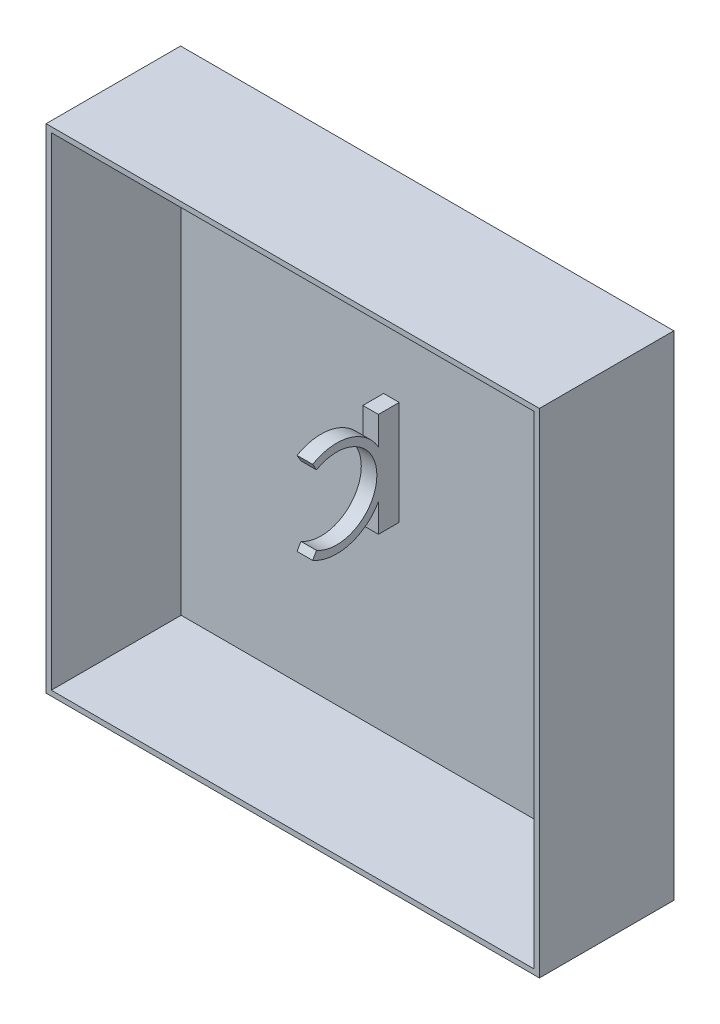
ISO-10303-21;
HEADER;
FILE_DESCRIPTION(('STEP AP214'),'2;1');
FILE_NAME('part.step','',(''),(''),'','','');
FILE_SCHEMA(('AUTOMOTIVE_DESIGN { 1 0 10303 214 1 1 1 1 }'));
ENDSEC;
DATA;
#1=APPLICATION_CONTEXT('core data for automotive mechanical design processes');
#2=APPLICATION_PROTOCOL_DEFINITION('international standard','automotive_design',2000,#1);
#3=PRODUCT_CONTEXT('',#1,'mechanical');
#4=PRODUCT('Part','Part','',(#3));
#5=PRODUCT_RELATED_PRODUCT_CATEGORY('part','',(#4));
#6=PRODUCT_DEFINITION_FORMATION('','',#4);
#7=PRODUCT_DEFINITION_CONTEXT('part definition',#1,'design');
#8=PRODUCT_DEFINITION('design','',#6,#7);
#9=PRODUCT_DEFINITION_SHAPE('','',#8);
#10=(LENGTH_UNIT() NAMED_UNIT(*) SI_UNIT(.MILLI.,.METRE.));
#11=(NAMED_UNIT(*) PLANE_ANGLE_UNIT() SI_UNIT($,.RADIAN.));
#12=(NAMED_UNIT(*) SI_UNIT($,.STERADIAN.) SOLID_ANGLE_UNIT());
#13=UNCERTAINTY_MEASURE_WITH_UNIT(LENGTH_MEASURE(1.E-05),#10,'distance_accuracy_value','');
#14=(GEOMETRIC_REPRESENTATION_CONTEXT(3) GLOBAL_UNCERTAINTY_ASSIGNED_CONTEXT((#13)) GLOBAL_UNIT_ASSIGNED_CONTEXT((#10,
#11,#12)) REPRESENTATION_CONTEXT('',''));
#15=CARTESIAN_POINT('',(0.,0.,0.));
#16=DIRECTION('',(0.,0.,1.));
#17=DIRECTION('',(1.,0.,0.));
#18=AXIS2_PLACEMENT_3D('',#15,#16,#17);
#19=CARTESIAN_POINT('',(0.,0.,4.9));
#20=DIRECTION('',(0.,0.,1.));
#21=DIRECTION('',(1.,0.,0.));
#22=AXIS2_PLACEMENT_3D('',#19,#20,#21);
#23=PLANE('',#22);
#24=DIRECTION('',(0.,1.,0.));
#25=VECTOR('',#24,1.);
#26=CARTESIAN_POINT('',(-4.5,10.,4.9));
#27=LINE('',#26,#25);
#28=CARTESIAN_POINT('',(-4.49999999999999,-10.,4.9));
#29=VERTEX_POINT('',#28);
#30=CARTESIAN_POINT('',(-4.49999999999999,-4.5563142999578,4.9));
#31=VERTEX_POINT('',#30);
#32=EDGE_CURVE('E264',#29,#31,#27,.T.);
#33=ORIENTED_EDGE('',*,*,#32,.T.);
#34=DIRECTION('',(-1.,0.,0.));
#35=VECTOR('',#34,1.);
#36=CARTESIAN_POINT('',(-4.49999999999999,-4.5563142999578,4.9));
#37=LINE('',#36,#35);
#38=CARTESIAN_POINT('',(-7.49999999999999,-4.5563142999578,4.9));
#39=VERTEX_POINT('',#38);
#40=EDGE_CURVE('E229',#31,#39,#37,.T.);
#41=ORIENTED_EDGE('',*,*,#40,.T.);
#42=DIRECTION('',(0.,-1.,0.));
#43=VECTOR('',#42,1.);
#44=CARTESIAN_POINT('',(-7.49999999999999,10.,4.9));
#45=LINE('',#44,#43);
#46=CARTESIAN_POINT('',(-7.49999999999999,-10.,4.9));
#47=VERTEX_POINT('',#46);
#48=EDGE_CURVE('E261',#39,#47,#45,.T.);
#49=ORIENTED_EDGE('',*,*,#48,.T.);
#50=DIRECTION('',(1.,0.,0.));
#51=VECTOR('',#50,1.);
#52=CARTESIAN_POINT('',(-7.49999999999999,-10.,4.9));
#53=LINE('',#52,#51);
#54=EDGE_CURVE('E260',#47,#29,#53,.T.);
#55=ORIENTED_EDGE('',*,*,#54,.T.);
#56=EDGE_LOOP('',(#33,#41,#49,#55));
#57=FACE_BOUND('',#56,.T.);
#58=ADVANCED_FACE('F33',(#57),#23,.T.);
#59=CARTESIAN_POINT('',(0.,0.,0.9));
#60=DIRECTION('',(0.,0.,1.));
#61=DIRECTION('',(1.,0.,0.));
#62=AXIS2_PLACEMENT_3D('',#59,#60,#61);
#63=PLANE('',#62);
#64=DIRECTION('',(-1.,0.,0.));
#65=VECTOR('',#64,1.);
#66=CARTESIAN_POINT('',(46.5,46.5,0.9));
#67=LINE('',#66,#65);
#68=CARTESIAN_POINT('',(46.5,46.5,0.9));
#69=VERTEX_POINT('',#68);
#70=CARTESIAN_POINT('',(-46.5,46.5,0.9));
#71=VERTEX_POINT('',#70);
#72=EDGE_CURVE('E285',#69,#71,#67,.T.);
#73=ORIENTED_EDGE('',*,*,#72,.T.);
#74=DIRECTION('',(0.,-1.,0.));
#75=VECTOR('',#74,1.);
#76=CARTESIAN_POINT('',(-46.5,46.5,0.9));
#77=LINE('',#76,#75);
#78=CARTESIAN_POINT('',(-46.5,-46.5,0.9));
#79=VERTEX_POINT('',#78);
#80=EDGE_CURVE('E298',#71,#79,#77,.T.);
#81=ORIENTED_EDGE('',*,*,#80,.T.);
#82=DIRECTION('',(1.,0.,0.));
#83=VECTOR('',#82,1.);
#84=CARTESIAN_POINT('',(-46.5,-46.5,0.9));
#85=LINE('',#84,#83);
#86=CARTESIAN_POINT('',(46.5,-46.5,0.9));
#87=VERTEX_POINT('',#86);
#88=EDGE_CURVE('E300',#79,#87,#85,.T.);
#89=ORIENTED_EDGE('',*,*,#88,.T.);
#90=DIRECTION('',(0.,1.,0.));
#91=VECTOR('',#90,1.);
#92=CARTESIAN_POINT('',(46.5,-46.5,0.9));
#93=LINE('',#92,#91);
#94=EDGE_CURVE('E289',#87,#69,#93,.T.);
#95=ORIENTED_EDGE('',*,*,#94,.T.);
#96=EDGE_LOOP('',(#73,#81,#89,#95));
#97=FACE_BOUND('',#96,.T.);
#98=DIRECTION('',(0.,1.,0.));
#99=VECTOR('',#98,1.);
#100=CARTESIAN_POINT('',(-40.5,39.9765258215962,0.9));
#101=LINE('',#100,#99);
#102=CARTESIAN_POINT('',(-40.5,34.9765258215962,0.9));
#103=VERTEX_POINT('',#102);
#104=CARTESIAN_POINT('',(-40.5,39.9765258215962,0.9));
#105=VERTEX_POINT('',#104);
#106=EDGE_CURVE('E360',#103,#105,#101,.T.);
#107=ORIENTED_EDGE('',*,*,#106,.F.);
#108=CARTESIAN_POINT('',(-42.5,33.4765258215962,0.9));
#109=DIRECTION('',(0.,0.,1.));
#110=DIRECTION('',(1.,0.,0.));
#111=AXIS2_PLACEMENT_3D('',#108,#109,#110);
#112=CIRCLE('',#111,2.5);
#113=CARTESIAN_POINT('',(-44.5,34.9765258215962,0.9));
#114=VERTEX_POINT('',#113);
#115=EDGE_CURVE('E358',#114,#103,#112,.T.);
#116=ORIENTED_EDGE('',*,*,#115,.F.);
#117=DIRECTION('',(0.,-1.,0.));
#118=VECTOR('',#117,1.);
#119=CARTESIAN_POINT('',(-44.5,39.9765258215962,0.9));
#120=LINE('',#119,#118);
#121=CARTESIAN_POINT('',(-44.5,39.9765258215962,0.9));
#122=VERTEX_POINT('',#121);
#123=EDGE_CURVE('E366',#122,#114,#120,.T.);
#124=ORIENTED_EDGE('',*,*,#123,.F.);
#125=CARTESIAN_POINT('',(-42.5,39.9765258215962,0.9));
#126=DIRECTION('',(0.,0.,1.));
#127=DIRECTION('',(1.,0.,0.));
#128=AXIS2_PLACEMENT_3D('',#125,#126,#127);
#129=CIRCLE('',#128,2.00000000000001);
#130=EDGE_CURVE('E363',#105,#122,#129,.T.);
#131=ORIENTED_EDGE('',*,*,#130,.F.);
#132=EDGE_LOOP('',(#107,#116,#124,#131));
#133=FACE_BOUND('',#132,.T.);
#134=DIRECTION('',(0.,-1.,0.));
#135=VECTOR('',#134,1.);
#136=CARTESIAN_POINT('',(40.5,39.9765258215962,0.9));
#137=LINE('',#136,#135);
#138=CARTESIAN_POINT('',(40.5,39.9765258215962,0.9));
#139=VERTEX_POINT('',#138);
#140=CARTESIAN_POINT('',(40.5,34.9765258215962,0.9));
#141=VERTEX_POINT('',#140);
#142=EDGE_CURVE('E329',#139,#141,#137,.T.);
#143=ORIENTED_EDGE('',*,*,#142,.F.);
#144=CARTESIAN_POINT('',(42.5,39.9765258215962,0.9));
#145=DIRECTION('',(0.,0.,1.));
#146=DIRECTION('',(-1.,0.,0.));
#147=AXIS2_PLACEMENT_3D('',#144,#145,#146);
#148=CIRCLE('',#147,2.00000000000001);
#149=CARTESIAN_POINT('',(44.5,39.9765258215962,0.9));
#150=VERTEX_POINT('',#149);
#151=EDGE_CURVE('E327',#150,#139,#148,.T.);
#152=ORIENTED_EDGE('',*,*,#151,.F.);
#153=DIRECTION('',(0.,1.,0.));
#154=VECTOR('',#153,1.);
#155=CARTESIAN_POINT('',(44.5,39.9765258215962,0.9));
#156=LINE('',#155,#154);
#157=CARTESIAN_POINT('',(44.5,34.9765258215962,0.9));
#158=VERTEX_POINT('',#157);
#159=EDGE_CURVE('E335',#158,#150,#156,.T.);
#160=ORIENTED_EDGE('',*,*,#159,.F.);
#161=CARTESIAN_POINT('',(42.5,33.4765258215962,0.9));
#162=DIRECTION('',(0.,0.,1.));
#163=DIRECTION('',(-1.,0.,0.));
#164=AXIS2_PLACEMENT_3D('',#161,#162,#163);
#165=CIRCLE('',#164,2.5);
#166=EDGE_CURVE('E332',#141,#158,#165,.T.);
#167=ORIENTED_EDGE('',*,*,#166,.F.);
#168=EDGE_LOOP('',(#143,#152,#160,#167));
#169=FACE_BOUND('',#168,.T.);
#170=DIRECTION('',(1.,0.,0.));
#171=VECTOR('',#170,1.);
#172=CARTESIAN_POINT('',(-7.49999999999999,-10.,0.9));
#173=LINE('',#172,#171);
#174=CARTESIAN_POINT('',(-7.49999999999999,-10.,0.9));
#175=VERTEX_POINT('',#174);
#176=CARTESIAN_POINT('',(-4.49999999999999,-10.,0.9));
#177=VERTEX_POINT('',#176);
#178=EDGE_CURVE('E271',#175,#177,#173,.T.);
#179=ORIENTED_EDGE('',*,*,#178,.F.);
#180=DIRECTION('',(0.,-1.,0.));
#181=VECTOR('',#180,1.);
#182=CARTESIAN_POINT('',(-7.49999999999999,10.,0.9));
#183=LINE('',#182,#181);
#184=CARTESIAN_POINT('',(-7.49999999999999,10.,0.9));
#185=VERTEX_POINT('',#184);
#186=EDGE_CURVE('E249',#185,#175,#183,.T.);
#187=ORIENTED_EDGE('',*,*,#186,.F.);
#188=DIRECTION('',(-1.,0.,0.));
#189=VECTOR('',#188,1.);
#190=CARTESIAN_POINT('',(-7.49999999999999,10.,0.9));
#191=LINE('',#190,#189);
#192=CARTESIAN_POINT('',(-4.5,10.,0.9));
#193=VERTEX_POINT('',#192);
#194=EDGE_CURVE('E275',#193,#185,#191,.T.);
#195=ORIENTED_EDGE('',*,*,#194,.F.);
#196=DIRECTION('',(0.,1.,0.));
#197=VECTOR('',#196,1.);
#198=CARTESIAN_POINT('',(-4.5,10.,0.9));
#199=LINE('',#198,#197);
#200=EDGE_CURVE('E273',#177,#193,#199,.T.);
#201=ORIENTED_EDGE('',*,*,#200,.F.);
#202=EDGE_LOOP('',(#179,#187,#195,#201));
#203=FACE_BOUND('',#202,.T.);
#204=ADVANCED_FACE('F430',(#97,#133,#169,#203),#63,.T.);
#205=CARTESIAN_POINT('',(0.,0.,0.));
#206=DIRECTION('',(0.,0.,1.));
#207=DIRECTION('',(1.,0.,0.));
#208=AXIS2_PLACEMENT_3D('',#205,#206,#207);
#209=PLANE('',#208);
#210=CARTESIAN_POINT('',(-42.5,33.4765258215962,0.));
#211=DIRECTION('',(0.,0.,1.));
#212=DIRECTION('',(1.,0.,0.));
#213=AXIS2_PLACEMENT_3D('',#210,#211,#212);
#214=CIRCLE('',#213,2.5);
#215=CARTESIAN_POINT('',(-44.5,34.9765258215962,0.));
#216=VERTEX_POINT('',#215);
#217=CARTESIAN_POINT('',(-40.5,34.9765258215962,0.));
#218=VERTEX_POINT('',#217);
#219=EDGE_CURVE('E357',#216,#218,#214,.T.);
#220=ORIENTED_EDGE('',*,*,#219,.T.);
#221=DIRECTION('',(0.,1.,0.));
#222=VECTOR('',#221,1.);
#223=CARTESIAN_POINT('',(-40.5,39.9765258215962,0.));
#224=LINE('',#223,#222);
#225=CARTESIAN_POINT('',(-40.5,39.9765258215962,0.));
#226=VERTEX_POINT('',#225);
#227=EDGE_CURVE('E371',#218,#226,#224,.T.);
#228=ORIENTED_EDGE('',*,*,#227,.T.);
#229=CARTESIAN_POINT('',(-42.5,39.9765258215962,0.));
#230=DIRECTION('',(0.,0.,1.));
#231=DIRECTION('',(1.,0.,0.));
#232=AXIS2_PLACEMENT_3D('',#229,#230,#231);
#233=CIRCLE('',#232,2.00000000000001);
#234=CARTESIAN_POINT('',(-44.5,39.9765258215962,0.));
#235=VERTEX_POINT('',#234);
#236=EDGE_CURVE('E374',#226,#235,#233,.T.);
#237=ORIENTED_EDGE('',*,*,#236,.T.);
#238=DIRECTION('',(0.,-1.,0.));
#239=VECTOR('',#238,1.);
#240=CARTESIAN_POINT('',(-44.5,39.9765258215962,0.));
#241=LINE('',#240,#239);
#242=EDGE_CURVE('E361',#235,#216,#241,.T.);
#243=ORIENTED_EDGE('',*,*,#242,.T.);
#244=EDGE_LOOP('',(#220,#228,#237,#243));
#245=FACE_BOUND('',#244,.T.);
#246=DIRECTION('',(0.,-1.,0.));
#247=VECTOR('',#246,1.);
#248=CARTESIAN_POINT('',(-47.5,-47.5,0.));
#249=LINE('',#248,#247);
#250=CARTESIAN_POINT('',(-47.5,47.5,0.));
#251=VERTEX_POINT('',#250);
#252=CARTESIAN_POINT('',(-47.5,-47.5,0.));
#253=VERTEX_POINT('',#252);
#254=EDGE_CURVE('E388',#251,#253,#249,.T.);
#255=ORIENTED_EDGE('',*,*,#254,.F.);
#256=DIRECTION('',(-1.,0.,0.));
#257=VECTOR('',#256,1.);
#258=CARTESIAN_POINT('',(47.5,47.5,0.));
#259=LINE('',#258,#257);
#260=CARTESIAN_POINT('',(47.5,47.5,0.));
#261=VERTEX_POINT('',#260);
#262=EDGE_CURVE('E395',#261,#251,#259,.T.);
#263=ORIENTED_EDGE('',*,*,#262,.F.);
#264=DIRECTION('',(0.,1.,0.));
#265=VECTOR('',#264,1.);
#266=CARTESIAN_POINT('',(47.5,-47.5,0.));
#267=LINE('',#266,#265);
#268=CARTESIAN_POINT('',(47.5,-47.5,0.));
#269=VERTEX_POINT('',#268);
#270=EDGE_CURVE('E393',#269,#261,#267,.T.);
#271=ORIENTED_EDGE('',*,*,#270,.F.);
#272=DIRECTION('',(1.,0.,0.));
#273=VECTOR('',#272,1.);
#274=CARTESIAN_POINT('',(47.5,-47.5,0.));
#275=LINE('',#274,#273);
#276=EDGE_CURVE('E391',#253,#269,#275,.T.);
#277=ORIENTED_EDGE('',*,*,#276,.F.);
#278=EDGE_LOOP('',(#255,#263,#271,#277));
#279=FACE_BOUND('',#278,.T.);
#280=CARTESIAN_POINT('',(42.5,39.9765258215962,0.));
#281=DIRECTION('',(0.,0.,1.));
#282=DIRECTION('',(-1.,0.,0.));
#283=AXIS2_PLACEMENT_3D('',#280,#281,#282);
#284=CIRCLE('',#283,2.00000000000001);
#285=CARTESIAN_POINT('',(44.5,39.9765258215962,0.));
#286=VERTEX_POINT('',#285);
#287=CARTESIAN_POINT('',(40.5,39.9765258215962,0.));
#288=VERTEX_POINT('',#287);
#289=EDGE_CURVE('E326',#286,#288,#284,.T.);
#290=ORIENTED_EDGE('',*,*,#289,.T.);
#291=DIRECTION('',(0.,-1.,0.));
#292=VECTOR('',#291,1.);
#293=CARTESIAN_POINT('',(40.5,39.9765258215962,0.));
#294=LINE('',#293,#292);
#295=CARTESIAN_POINT('',(40.5,34.9765258215962,0.));
#296=VERTEX_POINT('',#295);
#297=EDGE_CURVE('E340',#288,#296,#294,.T.);
#298=ORIENTED_EDGE('',*,*,#297,.T.);
#299=CARTESIAN_POINT('',(42.5,33.4765258215962,0.));
#300=DIRECTION('',(0.,0.,1.));
#301=DIRECTION('',(-1.,0.,0.));
#302=AXIS2_PLACEMENT_3D('',#299,#300,#301);
#303=CIRCLE('',#302,2.5);
#304=CARTESIAN_POINT('',(44.5,34.9765258215962,0.));
#305=VERTEX_POINT('',#304);
#306=EDGE_CURVE('E343',#296,#305,#303,.T.);
#307=ORIENTED_EDGE('',*,*,#306,.T.);
#308=DIRECTION('',(0.,1.,0.));
#309=VECTOR('',#308,1.);
#310=CARTESIAN_POINT('',(44.5,39.9765258215962,0.));
#311=LINE('',#310,#309);
#312=EDGE_CURVE('E330',#305,#286,#311,.T.);
#313=ORIENTED_EDGE('',*,*,#312,.T.);
#314=EDGE_LOOP('',(#290,#298,#307,#313));
#315=FACE_BOUND('',#314,.T.);
#316=ADVANCED_FACE('F412',(#245,#279,#315),#209,.F.);
#317=CARTESIAN_POINT('',(-47.5,-47.5,0.9));
#318=DIRECTION('',(1.,0.,0.));
#319=DIRECTION('',(0.,1.,0.));
#320=AXIS2_PLACEMENT_3D('',#317,#318,#319);
#321=PLANE('',#320);
#322=ORIENTED_EDGE('',*,*,#254,.T.);
#323=DIRECTION('',(0.,0.,-1.));
#324=VECTOR('',#323,1.);
#325=CARTESIAN_POINT('',(-47.5,-47.5,0.9));
#326=LINE('',#325,#324);
#327=CARTESIAN_POINT('',(-47.5,-47.5,25.9));
#328=VERTEX_POINT('',#327);
#329=EDGE_CURVE('E11',#328,#253,#326,.T.);
#330=ORIENTED_EDGE('',*,*,#329,.F.);
#331=DIRECTION('',(0.,-1.,0.));
#332=VECTOR('',#331,1.);
#333=CARTESIAN_POINT('',(-47.5,47.5,25.9));
#334=LINE('',#333,#332);
#335=CARTESIAN_POINT('',(-47.5,47.5,25.9));
#336=VERTEX_POINT('',#335);
#337=EDGE_CURVE('E317',#336,#328,#334,.T.);
#338=ORIENTED_EDGE('',*,*,#337,.F.);
#339=DIRECTION('',(0.,0.,-1.));
#340=VECTOR('',#339,1.);
#341=CARTESIAN_POINT('',(-47.5,47.5,0.9));
#342=LINE('',#341,#340);
#343=EDGE_CURVE('E397',#336,#251,#342,.T.);
#344=ORIENTED_EDGE('',*,*,#343,.T.);
#345=EDGE_LOOP('',(#322,#330,#338,#344));
#346=FACE_BOUND('',#345,.T.);
#347=ADVANCED_FACE('F35',(#346),#321,.F.);
#348=CARTESIAN_POINT('',(47.5,-47.5,0.9));
#349=DIRECTION('',(0.,1.,0.));
#350=DIRECTION('',(-1.,0.,0.));
#351=AXIS2_PLACEMENT_3D('',#348,#349,#350);
#352=PLANE('',#351);
#353=ORIENTED_EDGE('',*,*,#276,.T.);
#354=DIRECTION('',(0.,0.,-1.));
#355=VECTOR('',#354,1.);
#356=CARTESIAN_POINT('',(47.5,-47.5,0.9));
#357=LINE('',#356,#355);
#358=CARTESIAN_POINT('',(47.5,-47.5,25.9));
#359=VERTEX_POINT('',#358);
#360=EDGE_CURVE('E41',#359,#269,#357,.T.);
#361=ORIENTED_EDGE('',*,*,#360,.F.);
#362=DIRECTION('',(1.,0.,0.));
#363=VECTOR('',#362,1.);
#364=CARTESIAN_POINT('',(-47.5,-47.5,25.9));
#365=LINE('',#364,#363);
#366=EDGE_CURVE('E320',#328,#359,#365,.T.);
#367=ORIENTED_EDGE('',*,*,#366,.F.);
#368=ORIENTED_EDGE('',*,*,#329,.T.);
#369=EDGE_LOOP('',(#353,#361,#367,#368));
#370=FACE_BOUND('',#369,.T.);
#371=ADVANCED_FACE('F422',(#370),#352,.F.);
#372=CARTESIAN_POINT('',(47.5,-47.5,0.9));
#373=DIRECTION('',(-1.,0.,0.));
#374=DIRECTION('',(0.,-1.,0.));
#375=AXIS2_PLACEMENT_3D('',#372,#373,#374);
#376=PLANE('',#375);
#377=ORIENTED_EDGE('',*,*,#270,.T.);
#378=DIRECTION('',(0.,0.,-1.));
#379=VECTOR('',#378,1.);
#380=CARTESIAN_POINT('',(47.5,47.5,0.9));
#381=LINE('',#380,#379);
#382=CARTESIAN_POINT('',(47.5,47.5,25.9));
#383=VERTEX_POINT('',#382);
#384=EDGE_CURVE('E400',#383,#261,#381,.T.);
#385=ORIENTED_EDGE('',*,*,#384,.F.);
#386=DIRECTION('',(0.,1.,0.));
#387=VECTOR('',#386,1.);
#388=CARTESIAN_POINT('',(47.5,-47.5,25.9));
#389=LINE('',#388,#387);
#390=EDGE_CURVE('E323',#359,#383,#389,.T.);
#391=ORIENTED_EDGE('',*,*,#390,.F.);
#392=ORIENTED_EDGE('',*,*,#360,.T.);
#393=EDGE_LOOP('',(#377,#385,#391,#392));
#394=FACE_BOUND('',#393,.T.);
#395=ADVANCED_FACE('F406',(#394),#376,.F.);
#396=CARTESIAN_POINT('',(47.5,47.5,0.9));
#397=DIRECTION('',(0.,-1.,0.));
#398=DIRECTION('',(1.,0.,0.));
#399=AXIS2_PLACEMENT_3D('',#396,#397,#398);
#400=PLANE('',#399);
#401=ORIENTED_EDGE('',*,*,#262,.T.);
#402=ORIENTED_EDGE('',*,*,#343,.F.);
#403=DIRECTION('',(-1.,0.,0.));
#404=VECTOR('',#403,1.);
#405=CARTESIAN_POINT('',(47.5,47.5,25.9));
#406=LINE('',#405,#404);
#407=EDGE_CURVE('E314',#383,#336,#406,.T.);
#408=ORIENTED_EDGE('',*,*,#407,.F.);
#409=ORIENTED_EDGE('',*,*,#384,.T.);
#410=EDGE_LOOP('',(#401,#402,#408,#409));
#411=FACE_BOUND('',#410,.T.);
#412=ADVANCED_FACE('F415',(#411),#400,.F.);
#413=CARTESIAN_POINT('',(-42.5,33.4765258215962,0.9));
#414=DIRECTION('',(0.,0.,-1.));
#415=DIRECTION('',(-1.,0.,0.));
#416=AXIS2_PLACEMENT_3D('',#413,#414,#415);
#417=CYLINDRICAL_SURFACE('',#416,2.5);
#418=ORIENTED_EDGE('',*,*,#219,.F.);
#419=DIRECTION('',(0.,0.,-1.));
#420=VECTOR('',#419,1.);
#421=CARTESIAN_POINT('',(-44.5,34.9765258215962,0.9));
#422=LINE('',#421,#420);
#423=EDGE_CURVE('E368',#114,#216,#422,.T.);
#424=ORIENTED_EDGE('',*,*,#423,.F.);
#425=ORIENTED_EDGE('',*,*,#115,.T.);
#426=DIRECTION('',(0.,0.,-1.));
#427=VECTOR('',#426,1.);
#428=CARTESIAN_POINT('',(-40.5,34.9765258215962,0.9));
#429=LINE('',#428,#427);
#430=EDGE_CURVE('E385',#103,#218,#429,.T.);
#431=ORIENTED_EDGE('',*,*,#430,.T.);
#432=EDGE_LOOP('',(#418,#424,#425,#431));
#433=FACE_BOUND('',#432,.T.);
#434=ADVANCED_FACE('F529',(#433),#417,.F.);
#435=CARTESIAN_POINT('',(-40.5,39.9765258215962,0.9));
#436=DIRECTION('',(-1.,0.,0.));
#437=DIRECTION('',(0.,-1.,0.));
#438=AXIS2_PLACEMENT_3D('',#435,#436,#437);
#439=PLANE('',#438);
#440=ORIENTED_EDGE('',*,*,#227,.F.);
#441=ORIENTED_EDGE('',*,*,#430,.F.);
#442=ORIENTED_EDGE('',*,*,#106,.T.);
#443=DIRECTION('',(0.,0.,-1.));
#444=VECTOR('',#443,1.);
#445=CARTESIAN_POINT('',(-40.5,39.9765258215962,0.9));
#446=LINE('',#445,#444);
#447=EDGE_CURVE('E383',#105,#226,#446,.T.);
#448=ORIENTED_EDGE('',*,*,#447,.T.);
#449=EDGE_LOOP('',(#440,#441,#442,#448));
#450=FACE_BOUND('',#449,.T.);
#451=ADVANCED_FACE('F525',(#450),#439,.T.);
#452=CARTESIAN_POINT('',(-42.5,39.9765258215962,0.9));
#453=DIRECTION('',(0.,0.,-1.));
#454=DIRECTION('',(-1.,0.,0.));
#455=AXIS2_PLACEMENT_3D('',#452,#453,#454);
#456=CYLINDRICAL_SURFACE('',#455,2.00000000000001);
#457=ORIENTED_EDGE('',*,*,#236,.F.);
#458=ORIENTED_EDGE('',*,*,#447,.F.);
#459=ORIENTED_EDGE('',*,*,#130,.T.);
#460=DIRECTION('',(0.,0.,-1.));
#461=VECTOR('',#460,1.);
#462=CARTESIAN_POINT('',(-44.5,39.9765258215962,0.9));
#463=LINE('',#462,#461);
#464=EDGE_CURVE('E381',#122,#235,#463,.T.);
#465=ORIENTED_EDGE('',*,*,#464,.T.);
#466=EDGE_LOOP('',(#457,#458,#459,#465));
#467=FACE_BOUND('',#466,.T.);
#468=ADVANCED_FACE('F521',(#467),#456,.F.);
#469=CARTESIAN_POINT('',(-44.5,39.9765258215962,0.9));
#470=DIRECTION('',(1.,0.,0.));
#471=DIRECTION('',(0.,1.,0.));
#472=AXIS2_PLACEMENT_3D('',#469,#470,#471);
#473=PLANE('',#472);
#474=ORIENTED_EDGE('',*,*,#242,.F.);
#475=ORIENTED_EDGE('',*,*,#464,.F.);
#476=ORIENTED_EDGE('',*,*,#123,.T.);
#477=ORIENTED_EDGE('',*,*,#423,.T.);
#478=EDGE_LOOP('',(#474,#475,#476,#477));
#479=FACE_BOUND('',#478,.T.);
#480=ADVANCED_FACE('F517',(#479),#473,.T.);
#481=CARTESIAN_POINT('',(42.5,39.9765258215962,0.9));
#482=DIRECTION('',(0.,0.,-1.));
#483=DIRECTION('',(-1.,0.,0.));
#484=AXIS2_PLACEMENT_3D('',#481,#482,#483);
#485=CYLINDRICAL_SURFACE('',#484,2.00000000000001);
#486=ORIENTED_EDGE('',*,*,#289,.F.);
#487=DIRECTION('',(0.,0.,-1.));
#488=VECTOR('',#487,1.);
#489=CARTESIAN_POINT('',(44.5,39.9765258215962,0.9));
#490=LINE('',#489,#488);
#491=EDGE_CURVE('E337',#150,#286,#490,.T.);
#492=ORIENTED_EDGE('',*,*,#491,.F.);
#493=ORIENTED_EDGE('',*,*,#151,.T.);
#494=DIRECTION('',(0.,0.,-1.));
#495=VECTOR('',#494,1.);
#496=CARTESIAN_POINT('',(40.5,39.9765258215962,0.9));
#497=LINE('',#496,#495);
#498=EDGE_CURVE('E354',#139,#288,#497,.T.);
#499=ORIENTED_EDGE('',*,*,#498,.T.);
#500=EDGE_LOOP('',(#486,#492,#493,#499));
#501=FACE_BOUND('',#500,.T.);
#502=ADVANCED_FACE('F513',(#501),#485,.F.);
#503=CARTESIAN_POINT('',(40.5,39.9765258215962,0.9));
#504=DIRECTION('',(1.,0.,0.));
#505=DIRECTION('',(0.,1.,0.));
#506=AXIS2_PLACEMENT_3D('',#503,#504,#505);
#507=PLANE('',#506);
#508=ORIENTED_EDGE('',*,*,#297,.F.);
#509=ORIENTED_EDGE('',*,*,#498,.F.);
#510=ORIENTED_EDGE('',*,*,#142,.T.);
#511=DIRECTION('',(0.,0.,-1.));
#512=VECTOR('',#511,1.);
#513=CARTESIAN_POINT('',(40.5,34.9765258215962,0.9));
#514=LINE('',#513,#512);
#515=EDGE_CURVE('E352',#141,#296,#514,.T.);
#516=ORIENTED_EDGE('',*,*,#515,.T.);
#517=EDGE_LOOP('',(#508,#509,#510,#516));
#518=FACE_BOUND('',#517,.T.);
#519=ADVANCED_FACE('F509',(#518),#507,.T.);
#520=CARTESIAN_POINT('',(42.5,33.4765258215962,0.9));
#521=DIRECTION('',(0.,0.,-1.));
#522=DIRECTION('',(-1.,0.,0.));
#523=AXIS2_PLACEMENT_3D('',#520,#521,#522);
#524=CYLINDRICAL_SURFACE('',#523,2.5);
#525=ORIENTED_EDGE('',*,*,#306,.F.);
#526=ORIENTED_EDGE('',*,*,#515,.F.);
#527=ORIENTED_EDGE('',*,*,#166,.T.);
#528=DIRECTION('',(0.,0.,-1.));
#529=VECTOR('',#528,1.);
#530=CARTESIAN_POINT('',(44.5,34.9765258215962,0.9));
#531=LINE('',#530,#529);
#532=EDGE_CURVE('E350',#158,#305,#531,.T.);
#533=ORIENTED_EDGE('',*,*,#532,.T.);
#534=EDGE_LOOP('',(#525,#526,#527,#533));
#535=FACE_BOUND('',#534,.T.);
#536=ADVANCED_FACE('F505',(#535),#524,.F.);
#537=CARTESIAN_POINT('',(44.5,39.9765258215962,0.9));
#538=DIRECTION('',(-1.,0.,0.));
#539=DIRECTION('',(0.,-1.,0.));
#540=AXIS2_PLACEMENT_3D('',#537,#538,#539);
#541=PLANE('',#540);
#542=ORIENTED_EDGE('',*,*,#312,.F.);
#543=ORIENTED_EDGE('',*,*,#532,.F.);
#544=ORIENTED_EDGE('',*,*,#159,.T.);
#545=ORIENTED_EDGE('',*,*,#491,.T.);
#546=EDGE_LOOP('',(#542,#543,#544,#545));
#547=FACE_BOUND('',#546,.T.);
#548=ADVANCED_FACE('F502',(#547),#541,.T.);
#549=CARTESIAN_POINT('',(0.,0.,25.9));
#550=DIRECTION('',(0.,0.,1.));
#551=DIRECTION('',(1.,0.,0.));
#552=AXIS2_PLACEMENT_3D('',#549,#550,#551);
#553=PLANE('',#552);
#554=ORIENTED_EDGE('',*,*,#407,.T.);
#555=ORIENTED_EDGE('',*,*,#337,.T.);
#556=ORIENTED_EDGE('',*,*,#366,.T.);
#557=ORIENTED_EDGE('',*,*,#390,.T.);
#558=EDGE_LOOP('',(#554,#555,#556,#557));
#559=FACE_BOUND('',#558,.T.);
#560=DIRECTION('',(0.,-1.,0.));
#561=VECTOR('',#560,1.);
#562=CARTESIAN_POINT('',(-46.5,46.5,25.9));
#563=LINE('',#562,#561);
#564=CARTESIAN_POINT('',(-46.5,46.5,25.9));
#565=VERTEX_POINT('',#564);
#566=CARTESIAN_POINT('',(-46.5,-46.5,25.9));
#567=VERTEX_POINT('',#566);
#568=EDGE_CURVE('E288',#565,#567,#563,.T.);
#569=ORIENTED_EDGE('',*,*,#568,.F.);
#570=DIRECTION('',(-1.,0.,0.));
#571=VECTOR('',#570,1.);
#572=CARTESIAN_POINT('',(46.5,46.5,25.9));
#573=LINE('',#572,#571);
#574=CARTESIAN_POINT('',(46.5,46.5,25.9));
#575=VERTEX_POINT('',#574);
#576=EDGE_CURVE('E286',#575,#565,#573,.T.);
#577=ORIENTED_EDGE('',*,*,#576,.F.);
#578=DIRECTION('',(0.,1.,0.));
#579=VECTOR('',#578,1.);
#580=CARTESIAN_POINT('',(46.5,-46.5,25.9));
#581=LINE('',#580,#579);
#582=CARTESIAN_POINT('',(46.5,-46.5,25.9));
#583=VERTEX_POINT('',#582);
#584=EDGE_CURVE('E294',#583,#575,#581,.T.);
#585=ORIENTED_EDGE('',*,*,#584,.F.);
#586=DIRECTION('',(1.,0.,0.));
#587=VECTOR('',#586,1.);
#588=CARTESIAN_POINT('',(-46.5,-46.5,25.9));
#589=LINE('',#588,#587);
#590=EDGE_CURVE('E291',#567,#583,#589,.T.);
#591=ORIENTED_EDGE('',*,*,#590,.F.);
#592=EDGE_LOOP('',(#569,#577,#585,#591));
#593=FACE_BOUND('',#592,.T.);
#594=ADVANCED_FACE('F420',(#559,#593),#553,.T.);
#595=CARTESIAN_POINT('',(46.5,46.5,25.9));
#596=DIRECTION('',(0.,-1.,0.));
#597=DIRECTION('',(1.,0.,0.));
#598=AXIS2_PLACEMENT_3D('',#595,#596,#597);
#599=PLANE('',#598);
#600=ORIENTED_EDGE('',*,*,#72,.F.);
#601=DIRECTION('',(0.,0.,-1.));
#602=VECTOR('',#601,1.);
#603=CARTESIAN_POINT('',(46.5,46.5,25.9));
#604=LINE('',#603,#602);
#605=EDGE_CURVE('E296',#575,#69,#604,.T.);
#606=ORIENTED_EDGE('',*,*,#605,.F.);
#607=ORIENTED_EDGE('',*,*,#576,.T.);
#608=DIRECTION('',(0.,0.,-1.));
#609=VECTOR('',#608,1.);
#610=CARTESIAN_POINT('',(-46.5,46.5,25.9));
#611=LINE('',#610,#609);
#612=EDGE_CURVE('E311',#565,#71,#611,.T.);
#613=ORIENTED_EDGE('',*,*,#612,.T.);
#614=EDGE_LOOP('',(#600,#606,#607,#613));
#615=FACE_BOUND('',#614,.T.);
#616=ADVANCED_FACE('F495',(#615),#599,.T.);
#617=CARTESIAN_POINT('',(-46.5,46.5,25.9));
#618=DIRECTION('',(1.,0.,0.));
#619=DIRECTION('',(0.,1.,0.));
#620=AXIS2_PLACEMENT_3D('',#617,#618,#619);
#621=PLANE('',#620);
#622=ORIENTED_EDGE('',*,*,#80,.F.);
#623=ORIENTED_EDGE('',*,*,#612,.F.);
#624=ORIENTED_EDGE('',*,*,#568,.T.);
#625=DIRECTION('',(0.,0.,-1.));
#626=VECTOR('',#625,1.);
#627=CARTESIAN_POINT('',(-46.5,-46.5,25.9));
#628=LINE('',#627,#626);
#629=EDGE_CURVE('E308',#567,#79,#628,.T.);
#630=ORIENTED_EDGE('',*,*,#629,.T.);
#631=EDGE_LOOP('',(#622,#623,#624,#630));
#632=FACE_BOUND('',#631,.T.);
#633=ADVANCED_FACE('F491',(#632),#621,.T.);
#634=CARTESIAN_POINT('',(-46.5,-46.5,25.9));
#635=DIRECTION('',(0.,1.,0.));
#636=DIRECTION('',(-1.,0.,0.));
#637=AXIS2_PLACEMENT_3D('',#634,#635,#636);
#638=PLANE('',#637);
#639=ORIENTED_EDGE('',*,*,#88,.F.);
#640=ORIENTED_EDGE('',*,*,#629,.F.);
#641=ORIENTED_EDGE('',*,*,#590,.T.);
#642=DIRECTION('',(0.,0.,-1.));
#643=VECTOR('',#642,1.);
#644=CARTESIAN_POINT('',(46.5,-46.5,25.9));
#645=LINE('',#644,#643);
#646=EDGE_CURVE('E305',#583,#87,#645,.T.);
#647=ORIENTED_EDGE('',*,*,#646,.T.);
#648=EDGE_LOOP('',(#639,#640,#641,#647));
#649=FACE_BOUND('',#648,.T.);
#650=ADVANCED_FACE('F487',(#649),#638,.T.);
#651=CARTESIAN_POINT('',(46.5,-46.5,25.9));
#652=DIRECTION('',(-1.,0.,0.));
#653=DIRECTION('',(0.,0.,1.));
#654=AXIS2_PLACEMENT_3D('',#651,#652,#653);
#655=PLANE('',#654);
#656=ORIENTED_EDGE('',*,*,#94,.F.);
#657=ORIENTED_EDGE('',*,*,#646,.F.);
#658=ORIENTED_EDGE('',*,*,#584,.T.);
#659=ORIENTED_EDGE('',*,*,#605,.T.);
#660=EDGE_LOOP('',(#656,#657,#658,#659));
#661=FACE_BOUND('',#660,.T.);
#662=ADVANCED_FACE('F482',(#661),#655,.T.);
#663=CARTESIAN_POINT('',(-7.49999999999999,10.,4.9));
#664=DIRECTION('',(1.,0.,0.));
#665=DIRECTION('',(0.,0.,-1.));
#666=AXIS2_PLACEMENT_3D('',#663,#664,#665);
#667=PLANE('',#666);
#668=ORIENTED_EDGE('',*,*,#186,.T.);
#669=DIRECTION('',(0.,0.,-1.));
#670=VECTOR('',#669,1.);
#671=CARTESIAN_POINT('',(-7.49999999999999,-10.,4.9));
#672=LINE('',#671,#670);
#673=EDGE_CURVE('E283',#47,#175,#672,.T.);
#674=ORIENTED_EDGE('',*,*,#673,.F.);
#675=ORIENTED_EDGE('',*,*,#48,.F.);
#676=CARTESIAN_POINT('',(-7.49999999999999,0.,12.95));
#677=DIRECTION('',(-1.,0.,0.));
#678=DIRECTION('',(0.,0.,1.));
#679=AXIS2_PLACEMENT_3D('',#676,#677,#678);
#680=CIRCLE('',#679,9.25);
#681=CARTESIAN_POINT('',(-7.49999999999999,-8.01073498500608,17.5749999999999));
#682=VERTEX_POINT('',#681);
#683=EDGE_CURVE('E48',#39,#682,#680,.T.);
#684=ORIENTED_EDGE('',*,*,#683,.T.);
#685=DIRECTION('',(0.,0.866025403784441,-0.499999999999995));
#686=VECTOR('',#685,1.);
#687=CARTESIAN_POINT('',(-7.49999999999999,-8.01073498500608,17.5749999999999));
#688=LINE('',#687,#686);
#689=CARTESIAN_POINT('',(-7.49999999999999,-6.71169687932943,16.825));
#690=VERTEX_POINT('',#689);
#691=EDGE_CURVE('E212',#682,#690,#688,.T.);
#692=ORIENTED_EDGE('',*,*,#691,.T.);
#693=CARTESIAN_POINT('',(-7.49999999999999,0.,12.95));
#694=DIRECTION('',(1.,0.,0.));
#695=DIRECTION('',(0.,0.,1.));
#696=AXIS2_PLACEMENT_3D('',#693,#694,#695);
#697=CIRCLE('',#696,7.75);
#698=CARTESIAN_POINT('',(-7.49999999999999,6.71169687932943,16.825));
#699=VERTEX_POINT('',#698);
#700=EDGE_CURVE('E243',#690,#699,#697,.T.);
#701=ORIENTED_EDGE('',*,*,#700,.T.);
#702=DIRECTION('',(0.,0.866025403784441,0.499999999999995));
#703=VECTOR('',#702,1.);
#704=CARTESIAN_POINT('',(-7.49999999999999,8.01073498500608,17.5749999999999));
#705=LINE('',#704,#703);
#706=CARTESIAN_POINT('',(-7.49999999999999,8.01073498500608,17.5749999999999));
#707=VERTEX_POINT('',#706);
#708=EDGE_CURVE('E233',#699,#707,#705,.T.);
#709=ORIENTED_EDGE('',*,*,#708,.T.);
#710=CARTESIAN_POINT('',(-7.49999999999999,0.,12.95));
#711=DIRECTION('',(-1.,0.,0.));
#712=DIRECTION('',(0.,0.,1.));
#713=AXIS2_PLACEMENT_3D('',#710,#711,#712);
#714=CIRCLE('',#713,9.25);
#715=CARTESIAN_POINT('',(-7.49999999999999,4.5563142999578,4.9));
#716=VERTEX_POINT('',#715);
#717=EDGE_CURVE('E230',#707,#716,#714,.T.);
#718=ORIENTED_EDGE('',*,*,#717,.T.);
#719=CARTESIAN_POINT('',(-7.49999999999999,10.,4.9));
#720=VERTEX_POINT('',#719);
#721=EDGE_CURVE('E257',#720,#716,#45,.T.);
#722=ORIENTED_EDGE('',*,*,#721,.F.);
#723=DIRECTION('',(0.,0.,-1.));
#724=VECTOR('',#723,1.);
#725=CARTESIAN_POINT('',(-7.49999999999999,10.,4.9));
#726=LINE('',#725,#724);
#727=EDGE_CURVE('E268',#720,#185,#726,.T.);
#728=ORIENTED_EDGE('',*,*,#727,.T.);
#729=EDGE_LOOP('',(#668,#674,#675,#684,#692,#701,#709,#718,#722,#728));
#730=FACE_BOUND('',#729,.T.);
#731=ADVANCED_FACE('F460',(#730),#667,.F.);
#732=CARTESIAN_POINT('',(-7.49999999999999,-10.,4.9));
#733=DIRECTION('',(0.,1.,0.));
#734=DIRECTION('',(-1.,0.,0.));
#735=AXIS2_PLACEMENT_3D('',#732,#733,#734);
#736=PLANE('',#735);
#737=ORIENTED_EDGE('',*,*,#178,.T.);
#738=DIRECTION('',(0.,0.,-1.));
#739=VECTOR('',#738,1.);
#740=CARTESIAN_POINT('',(-4.49999999999999,-10.,4.9));
#741=LINE('',#740,#739);
#742=EDGE_CURVE('E280',#29,#177,#741,.T.);
#743=ORIENTED_EDGE('',*,*,#742,.F.);
#744=ORIENTED_EDGE('',*,*,#54,.F.);
#745=ORIENTED_EDGE('',*,*,#673,.T.);
#746=EDGE_LOOP('',(#737,#743,#744,#745));
#747=FACE_BOUND('',#746,.T.);
#748=ADVANCED_FACE('F472',(#747),#736,.F.);
#749=CARTESIAN_POINT('',(-4.5,10.,4.9));
#750=DIRECTION('',(-1.,0.,0.));
#751=DIRECTION('',(0.,-1.,0.));
#752=AXIS2_PLACEMENT_3D('',#749,#750,#751);
#753=PLANE('',#752);
#754=ORIENTED_EDGE('',*,*,#200,.T.);
#755=DIRECTION('',(0.,0.,-1.));
#756=VECTOR('',#755,1.);
#757=CARTESIAN_POINT('',(-4.5,10.,4.9));
#758=LINE('',#757,#756);
#759=CARTESIAN_POINT('',(-4.5,10.,4.9));
#760=VERTEX_POINT('',#759);
#761=EDGE_CURVE('E56',#760,#193,#758,.T.);
#762=ORIENTED_EDGE('',*,*,#761,.F.);
#763=CARTESIAN_POINT('',(-4.49999999999999,4.5563142999578,4.9));
#764=VERTEX_POINT('',#763);
#765=EDGE_CURVE('E263',#764,#760,#27,.T.);
#766=ORIENTED_EDGE('',*,*,#765,.F.);
#767=CARTESIAN_POINT('',(-4.49999999999999,0.,12.95));
#768=DIRECTION('',(-1.,0.,0.));
#769=DIRECTION('',(0.,0.,1.));
#770=AXIS2_PLACEMENT_3D('',#767,#768,#769);
#771=CIRCLE('',#770,9.25);
#772=CARTESIAN_POINT('',(-4.49999999999999,8.01073498500608,17.5749999999999));
#773=VERTEX_POINT('',#772);
#774=EDGE_CURVE('E215',#773,#764,#771,.T.);
#775=ORIENTED_EDGE('',*,*,#774,.F.);
#776=DIRECTION('',(0.,0.866025403784441,0.499999999999995));
#777=VECTOR('',#776,1.);
#778=CARTESIAN_POINT('',(-4.49999999999999,8.01073498500608,17.5749999999999));
#779=LINE('',#778,#777);
#780=CARTESIAN_POINT('',(-4.49999999999999,6.71169687932943,16.825));
#781=VERTEX_POINT('',#780);
#782=EDGE_CURVE('E237',#781,#773,#779,.T.);
#783=ORIENTED_EDGE('',*,*,#782,.F.);
#784=CARTESIAN_POINT('',(-4.49999999999999,0.,12.95));
#785=DIRECTION('',(1.,0.,0.));
#786=DIRECTION('',(0.,0.,1.));
#787=AXIS2_PLACEMENT_3D('',#784,#785,#786);
#788=CIRCLE('',#787,7.75);
#789=CARTESIAN_POINT('',(-4.49999999999999,-6.71169687932943,16.825));
#790=VERTEX_POINT('',#789);
#791=EDGE_CURVE('E226',#790,#781,#788,.T.);
#792=ORIENTED_EDGE('',*,*,#791,.F.);
#793=DIRECTION('',(0.,0.866025403784441,-0.499999999999995));
#794=VECTOR('',#793,1.);
#795=CARTESIAN_POINT('',(-4.49999999999999,-8.01073498500608,17.5749999999999));
#796=LINE('',#795,#794);
#797=CARTESIAN_POINT('',(-4.49999999999999,-8.01073498500608,17.5749999999999));
#798=VERTEX_POINT('',#797);
#799=EDGE_CURVE('E210',#798,#790,#796,.T.);
#800=ORIENTED_EDGE('',*,*,#799,.F.);
#801=CARTESIAN_POINT('',(-4.49999999999999,0.,12.95));
#802=DIRECTION('',(-1.,0.,0.));
#803=DIRECTION('',(0.,0.,1.));
#804=AXIS2_PLACEMENT_3D('',#801,#802,#803);
#805=CIRCLE('',#804,9.25);
#806=EDGE_CURVE('E222',#31,#798,#805,.T.);
#807=ORIENTED_EDGE('',*,*,#806,.F.);
#808=ORIENTED_EDGE('',*,*,#32,.F.);
#809=ORIENTED_EDGE('',*,*,#742,.T.);
#810=EDGE_LOOP('',(#754,#762,#766,#775,#783,#792,#800,#807,#808,#809));
#811=FACE_BOUND('',#810,.T.);
#812=ADVANCED_FACE('F220',(#811),#753,.F.);
#813=CARTESIAN_POINT('',(-7.49999999999999,10.,4.9));
#814=DIRECTION('',(0.,-1.,0.));
#815=DIRECTION('',(1.,0.,0.));
#816=AXIS2_PLACEMENT_3D('',#813,#814,#815);
#817=PLANE('',#816);
#818=ORIENTED_EDGE('',*,*,#194,.T.);
#819=ORIENTED_EDGE('',*,*,#727,.F.);
#820=DIRECTION('',(-1.,0.,0.));
#821=VECTOR('',#820,1.);
#822=CARTESIAN_POINT('',(-7.49999999999999,10.,4.9));
#823=LINE('',#822,#821);
#824=EDGE_CURVE('E266',#760,#720,#823,.T.);
#825=ORIENTED_EDGE('',*,*,#824,.F.);
#826=ORIENTED_EDGE('',*,*,#761,.T.);
#827=EDGE_LOOP('',(#818,#819,#825,#826));
#828=FACE_BOUND('',#827,.T.);
#829=ADVANCED_FACE('F442',(#828),#817,.F.);
#830=DIRECTION('',(-1.,0.,0.));
#831=VECTOR('',#830,1.);
#832=CARTESIAN_POINT('',(-4.49999999999999,4.5563142999578,4.9));
#833=LINE('',#832,#831);
#834=EDGE_CURVE('E250',#764,#716,#833,.T.);
#835=ORIENTED_EDGE('',*,*,#834,.F.);
#836=ORIENTED_EDGE('',*,*,#765,.T.);
#837=ORIENTED_EDGE('',*,*,#824,.T.);
#838=ORIENTED_EDGE('',*,*,#721,.T.);
#839=EDGE_LOOP('',(#835,#836,#837,#838));
#840=FACE_BOUND('',#839,.T.);
#841=ADVANCED_FACE('F433',(#840),#23,.T.);
#842=CARTESIAN_POINT('',(-4.49999999999999,0.,12.95));
#843=DIRECTION('',(-1.,0.,0.));
#844=DIRECTION('',(0.,0.,1.));
#845=AXIS2_PLACEMENT_3D('',#842,#843,#844);
#846=CYLINDRICAL_SURFACE('',#845,9.25);
#847=ORIENTED_EDGE('',*,*,#683,.F.);
#848=ORIENTED_EDGE('',*,*,#40,.F.);
#849=ORIENTED_EDGE('',*,*,#806,.T.);
#850=DIRECTION('',(-1.,0.,0.));
#851=VECTOR('',#850,1.);
#852=CARTESIAN_POINT('',(-4.49999999999999,-8.01073498500608,17.5749999999999));
#853=LINE('',#852,#851);
#854=EDGE_CURVE('E207',#798,#682,#853,.T.);
#855=ORIENTED_EDGE('',*,*,#854,.T.);
#856=EDGE_LOOP('',(#847,#848,#849,#855));
#857=FACE_BOUND('',#856,.T.);
#858=ADVANCED_FACE('F228',(#857),#846,.T.);
#859=CARTESIAN_POINT('',(-4.49999999999999,0.,12.95));
#860=DIRECTION('',(-1.,0.,0.));
#861=DIRECTION('',(0.,0.,1.));
#862=AXIS2_PLACEMENT_3D('',#859,#860,#861);
#863=CYLINDRICAL_SURFACE('',#862,9.25);
#864=ORIENTED_EDGE('',*,*,#717,.F.);
#865=DIRECTION('',(-1.,0.,0.));
#866=VECTOR('',#865,1.);
#867=CARTESIAN_POINT('',(-4.49999999999999,8.01073498500608,17.5749999999999));
#868=LINE('',#867,#866);
#869=EDGE_CURVE('E252',#773,#707,#868,.T.);
#870=ORIENTED_EDGE('',*,*,#869,.F.);
#871=ORIENTED_EDGE('',*,*,#774,.T.);
#872=ORIENTED_EDGE('',*,*,#834,.T.);
#873=EDGE_LOOP('',(#864,#870,#871,#872));
#874=FACE_BOUND('',#873,.T.);
#875=ADVANCED_FACE('F448',(#874),#863,.T.);
#876=CARTESIAN_POINT('',(-4.49999999999999,8.01073498500608,17.5749999999999));
#877=DIRECTION('',(0.,-0.499999999999995,0.866025403784441));
#878=DIRECTION('',(0.,-0.866025403784441,-0.499999999999995));
#879=AXIS2_PLACEMENT_3D('',#876,#877,#878);
#880=PLANE('',#879);
#881=ORIENTED_EDGE('',*,*,#708,.F.);
#882=DIRECTION('',(-1.,0.,0.));
#883=VECTOR('',#882,1.);
#884=CARTESIAN_POINT('',(-4.49999999999999,6.71169687932943,16.825));
#885=LINE('',#884,#883);
#886=EDGE_CURVE('E254',#781,#699,#885,.T.);
#887=ORIENTED_EDGE('',*,*,#886,.F.);
#888=ORIENTED_EDGE('',*,*,#782,.T.);
#889=ORIENTED_EDGE('',*,*,#869,.T.);
#890=EDGE_LOOP('',(#881,#887,#888,#889));
#891=FACE_BOUND('',#890,.T.);
#892=ADVANCED_FACE('F463',(#891),#880,.T.);
#893=CARTESIAN_POINT('',(-4.49999999999999,0.,12.95));
#894=DIRECTION('',(-1.,0.,0.));
#895=DIRECTION('',(0.,0.,1.));
#896=AXIS2_PLACEMENT_3D('',#893,#894,#895);
#897=CYLINDRICAL_SURFACE('',#896,7.75);
#898=ORIENTED_EDGE('',*,*,#700,.F.);
#899=DIRECTION('',(-1.,0.,0.));
#900=VECTOR('',#899,1.);
#901=CARTESIAN_POINT('',(-4.49999999999999,-6.71169687932943,16.825));
#902=LINE('',#901,#900);
#903=EDGE_CURVE('E214',#790,#690,#902,.T.);
#904=ORIENTED_EDGE('',*,*,#903,.F.);
#905=ORIENTED_EDGE('',*,*,#791,.T.);
#906=ORIENTED_EDGE('',*,*,#886,.T.);
#907=EDGE_LOOP('',(#898,#904,#905,#906));
#908=FACE_BOUND('',#907,.T.);
#909=ADVANCED_FACE('F466',(#908),#897,.F.);
#910=CARTESIAN_POINT('',(-4.49999999999999,-8.01073498500608,17.5749999999999));
#911=DIRECTION('',(0.,0.499999999999995,0.866025403784441));
#912=DIRECTION('',(0.,-0.866025403784441,0.499999999999995));
#913=AXIS2_PLACEMENT_3D('',#910,#911,#912);
#914=PLANE('',#913);
#915=ORIENTED_EDGE('',*,*,#691,.F.);
#916=ORIENTED_EDGE('',*,*,#854,.F.);
#917=ORIENTED_EDGE('',*,*,#799,.T.);
#918=ORIENTED_EDGE('',*,*,#903,.T.);
#919=EDGE_LOOP('',(#915,#916,#917,#918));
#920=FACE_BOUND('',#919,.T.);
#921=ADVANCED_FACE('F209',(#920),#914,.T.);
#922=CLOSED_SHELL('',(#58,#204,#316,#347,#371,#395,#412,#434,#451,#468,#480,#502,#519,#536,#548,
#594,#616,#633,#650,#662,#731,#748,#812,#829,#841,#858,#875,#892,#909,#921));
#923=MANIFOLD_SOLID_BREP('B2',#922);
#924=ADVANCED_BREP_SHAPE_REPRESENTATION('',(#18,#923),#14);
#925=SHAPE_DEFINITION_REPRESENTATION(#9,#924);
ENDSEC;
END-ISO-10303-21;
